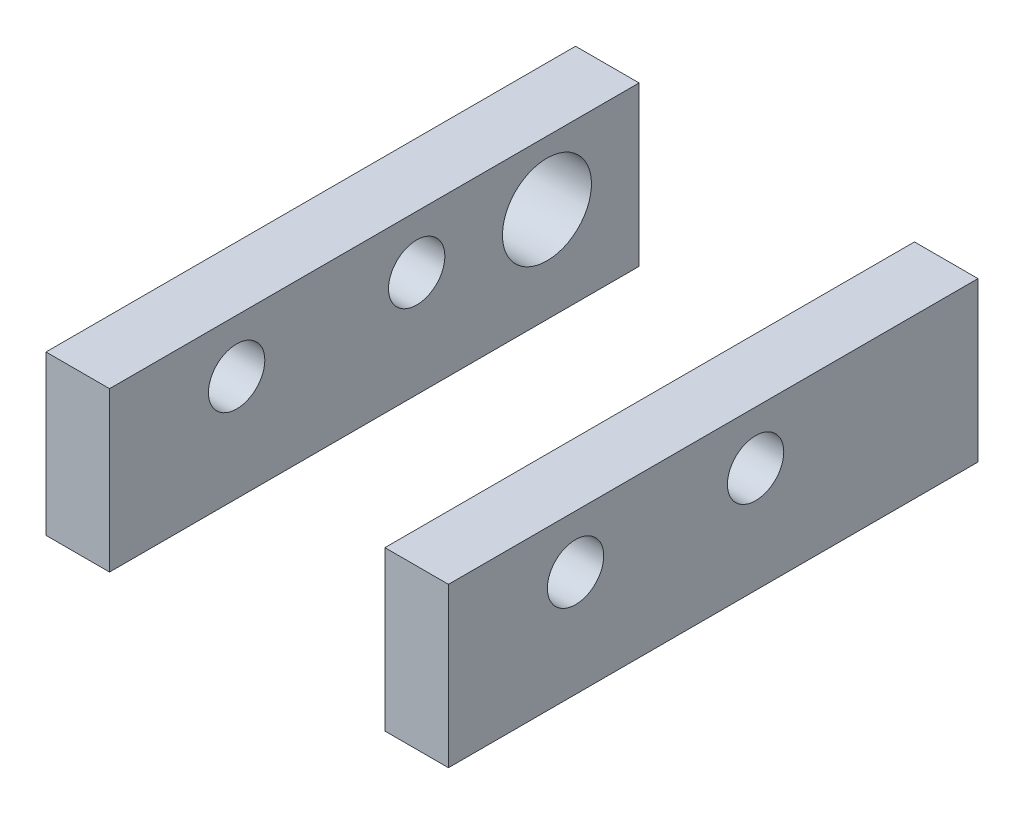
ISO-10303-21;
HEADER;
FILE_DESCRIPTION(('STEP AP214'),'2;1');
FILE_NAME('part.step','',(''),(''),'','','');
FILE_SCHEMA(('AUTOMOTIVE_DESIGN { 1 0 10303 214 1 1 1 1 }'));
ENDSEC;
DATA;
#1=APPLICATION_CONTEXT('core data for automotive mechanical design processes');
#2=APPLICATION_PROTOCOL_DEFINITION('international standard','automotive_design',2000,#1);
#3=PRODUCT_CONTEXT('',#1,'mechanical');
#4=PRODUCT('Part','Part','',(#3));
#5=PRODUCT_RELATED_PRODUCT_CATEGORY('part','',(#4));
#6=PRODUCT_DEFINITION_FORMATION('','',#4);
#7=PRODUCT_DEFINITION_CONTEXT('part definition',#1,'design');
#8=PRODUCT_DEFINITION('design','',#6,#7);
#9=PRODUCT_DEFINITION_SHAPE('','',#8);
#10=(LENGTH_UNIT() NAMED_UNIT(*) SI_UNIT(.MILLI.,.METRE.));
#11=(NAMED_UNIT(*) PLANE_ANGLE_UNIT() SI_UNIT($,.RADIAN.));
#12=(NAMED_UNIT(*) SI_UNIT($,.STERADIAN.) SOLID_ANGLE_UNIT());
#13=UNCERTAINTY_MEASURE_WITH_UNIT(LENGTH_MEASURE(1.E-05),#10,'distance_accuracy_value','');
#14=(GEOMETRIC_REPRESENTATION_CONTEXT(3) GLOBAL_UNCERTAINTY_ASSIGNED_CONTEXT((#13)) GLOBAL_UNIT_ASSIGNED_CONTEXT((#10,
#11,#12)) REPRESENTATION_CONTEXT('',''));
#15=CARTESIAN_POINT('',(0.,0.,0.));
#16=DIRECTION('',(0.,0.,1.));
#17=DIRECTION('',(1.,0.,0.));
#18=AXIS2_PLACEMENT_3D('',#15,#16,#17);
#19=CARTESIAN_POINT('',(-7.62,-2.54000000000001,63.5));
#20=DIRECTION('',(0.,1.,0.));
#21=DIRECTION('',(-1.,0.,0.));
#22=AXIS2_PLACEMENT_3D('',#19,#20,#21);
#23=PLANE('',#22);
#24=DIRECTION('',(0.,0.,-1.));
#25=VECTOR('',#24,1.);
#26=CARTESIAN_POINT('',(33.02,-2.54,63.500012));
#27=LINE('',#26,#25);
#28=CARTESIAN_POINT('',(33.02,-2.54,63.5));
#29=VERTEX_POINT('',#28);
#30=CARTESIAN_POINT('',(33.02,-2.54,0.));
#31=VERTEX_POINT('',#30);
#32=EDGE_CURVE('E133',#29,#31,#27,.T.);
#33=ORIENTED_EDGE('',*,*,#32,.T.);
#34=DIRECTION('',(1.,0.,0.));
#35=VECTOR('',#34,1.);
#36=CARTESIAN_POINT('',(-7.62,-2.54000000000001,0.));
#37=LINE('',#36,#35);
#38=CARTESIAN_POINT('',(40.64,-2.54,0.));
#39=VERTEX_POINT('',#38);
#40=EDGE_CURVE('E95',#31,#39,#37,.T.);
#41=ORIENTED_EDGE('',*,*,#40,.T.);
#42=DIRECTION('',(0.,0.,-1.));
#43=VECTOR('',#42,1.);
#44=CARTESIAN_POINT('',(40.64,-2.54,63.5));
#45=LINE('',#44,#43);
#46=CARTESIAN_POINT('',(40.64,-2.54,63.5));
#47=VERTEX_POINT('',#46);
#48=EDGE_CURVE('E110',#47,#39,#45,.T.);
#49=ORIENTED_EDGE('',*,*,#48,.F.);
#50=DIRECTION('',(1.,0.,0.));
#51=VECTOR('',#50,1.);
#52=CARTESIAN_POINT('',(-7.62,-2.54000000000001,63.5));
#53=LINE('',#52,#51);
#54=EDGE_CURVE('E131',#29,#47,#53,.T.);
#55=ORIENTED_EDGE('',*,*,#54,.F.);
#56=EDGE_LOOP('',(#33,#41,#49,#55));
#57=FACE_BOUND('',#56,.T.);
#58=ADVANCED_FACE('F51',(#57),#23,.F.);
#59=CARTESIAN_POINT('',(0.,0.,63.5));
#60=DIRECTION('',(0.,0.,-1.));
#61=DIRECTION('',(-1.,0.,0.));
#62=AXIS2_PLACEMENT_3D('',#59,#60,#61);
#63=PLANE('',#62);
#64=DIRECTION('',(0.,-1.,0.));
#65=VECTOR('',#64,1.);
#66=CARTESIAN_POINT('',(33.02,0.,63.5));
#67=LINE('',#66,#65);
#68=CARTESIAN_POINT('',(33.02,16.51,63.5));
#69=VERTEX_POINT('',#68);
#70=EDGE_CURVE('E68',#69,#29,#67,.T.);
#71=ORIENTED_EDGE('',*,*,#70,.T.);
#72=ORIENTED_EDGE('',*,*,#54,.T.);
#73=DIRECTION('',(0.,1.,0.));
#74=VECTOR('',#73,1.);
#75=CARTESIAN_POINT('',(40.64,-2.54,63.5));
#76=LINE('',#75,#74);
#77=CARTESIAN_POINT('',(40.64,16.51,63.5));
#78=VERTEX_POINT('',#77);
#79=EDGE_CURVE('E129',#47,#78,#76,.T.);
#80=ORIENTED_EDGE('',*,*,#79,.T.);
#81=DIRECTION('',(-1.,0.,0.));
#82=VECTOR('',#81,1.);
#83=CARTESIAN_POINT('',(33.02,16.51,63.5));
#84=LINE('',#83,#82);
#85=EDGE_CURVE('E126',#78,#69,#84,.T.);
#86=ORIENTED_EDGE('',*,*,#85,.T.);
#87=EDGE_LOOP('',(#71,#72,#80,#86));
#88=FACE_BOUND('',#87,.T.);
#89=ADVANCED_FACE('F169',(#88),#63,.F.);
#90=CARTESIAN_POINT('',(0.,0.,0.));
#91=DIRECTION('',(0.,0.,-1.));
#92=DIRECTION('',(-1.,0.,0.));
#93=AXIS2_PLACEMENT_3D('',#90,#91,#92);
#94=PLANE('',#93);
#95=ORIENTED_EDGE('',*,*,#40,.F.);
#96=DIRECTION('',(0.,1.,0.));
#97=VECTOR('',#96,1.);
#98=CARTESIAN_POINT('',(33.02,0.,0.));
#99=LINE('',#98,#97);
#100=CARTESIAN_POINT('',(33.02,16.51,0.));
#101=VERTEX_POINT('',#100);
#102=EDGE_CURVE('E90',#31,#101,#99,.T.);
#103=ORIENTED_EDGE('',*,*,#102,.T.);
#104=DIRECTION('',(-1.,0.,0.));
#105=VECTOR('',#104,1.);
#106=CARTESIAN_POINT('',(33.02,16.51,0.));
#107=LINE('',#106,#105);
#108=CARTESIAN_POINT('',(40.64,16.51,0.));
#109=VERTEX_POINT('',#108);
#110=EDGE_CURVE('E94',#109,#101,#107,.T.);
#111=ORIENTED_EDGE('',*,*,#110,.F.);
#112=DIRECTION('',(0.,1.,0.));
#113=VECTOR('',#112,1.);
#114=CARTESIAN_POINT('',(40.64,-2.54,0.));
#115=LINE('',#114,#113);
#116=EDGE_CURVE('E100',#39,#109,#115,.T.);
#117=ORIENTED_EDGE('',*,*,#116,.F.);
#118=EDGE_LOOP('',(#95,#103,#111,#117));
#119=FACE_BOUND('',#118,.T.);
#120=ADVANCED_FACE('F92',(#119),#94,.T.);
#121=CARTESIAN_POINT('',(40.64,-2.54,63.5));
#122=DIRECTION('',(-1.,0.,0.));
#123=DIRECTION('',(0.,0.,1.));
#124=AXIS2_PLACEMENT_3D('',#121,#122,#123);
#125=PLANE('',#124);
#126=CARTESIAN_POINT('',(40.64,10.16,26.67));
#127=DIRECTION('',(1.,0.,0.));
#128=DIRECTION('',(0.,0.,-1.));
#129=AXIS2_PLACEMENT_3D('',#126,#127,#128);
#130=CIRCLE('',#129,3.3782);
#131=CARTESIAN_POINT('',(40.64,10.16,23.2918));
#132=VERTEX_POINT('',#131);
#133=EDGE_CURVE('E147',#132,#132,#130,.T.);
#134=ORIENTED_EDGE('',*,*,#133,.F.);
#135=EDGE_LOOP('',(#134));
#136=FACE_BOUND('',#135,.T.);
#137=CARTESIAN_POINT('',(40.64,10.16,48.26));
#138=DIRECTION('',(1.,0.,0.));
#139=DIRECTION('',(0.,0.,-1.));
#140=AXIS2_PLACEMENT_3D('',#137,#138,#139);
#141=CIRCLE('',#140,3.3782);
#142=CARTESIAN_POINT('',(40.64,10.16,44.8818));
#143=VERTEX_POINT('',#142);
#144=EDGE_CURVE('E12',#143,#143,#141,.T.);
#145=ORIENTED_EDGE('',*,*,#144,.F.);
#146=EDGE_LOOP('',(#145));
#147=FACE_BOUND('',#146,.T.);
#148=ORIENTED_EDGE('',*,*,#116,.T.);
#149=DIRECTION('',(0.,0.,-1.));
#150=VECTOR('',#149,1.);
#151=CARTESIAN_POINT('',(40.64,16.51,63.5));
#152=LINE('',#151,#150);
#153=EDGE_CURVE('E108',#78,#109,#152,.T.);
#154=ORIENTED_EDGE('',*,*,#153,.F.);
#155=ORIENTED_EDGE('',*,*,#79,.F.);
#156=ORIENTED_EDGE('',*,*,#48,.T.);
#157=EDGE_LOOP('',(#148,#154,#155,#156));
#158=FACE_BOUND('',#157,.T.);
#159=ADVANCED_FACE('F144',(#136,#147,#158),#125,.F.);
#160=CARTESIAN_POINT('',(33.02,16.51,63.5));
#161=DIRECTION('',(0.,-1.,0.));
#162=DIRECTION('',(0.,0.,-1.));
#163=AXIS2_PLACEMENT_3D('',#160,#161,#162);
#164=PLANE('',#163);
#165=ORIENTED_EDGE('',*,*,#110,.T.);
#166=DIRECTION('',(0.,0.,-1.));
#167=VECTOR('',#166,1.);
#168=CARTESIAN_POINT('',(33.02,16.51,63.5));
#169=LINE('',#168,#167);
#170=EDGE_CURVE('E61',#69,#101,#169,.T.);
#171=ORIENTED_EDGE('',*,*,#170,.F.);
#172=ORIENTED_EDGE('',*,*,#85,.F.);
#173=ORIENTED_EDGE('',*,*,#153,.T.);
#174=EDGE_LOOP('',(#165,#171,#172,#173));
#175=FACE_BOUND('',#174,.T.);
#176=ADVANCED_FACE('F105',(#175),#164,.F.);
#177=CARTESIAN_POINT('',(33.02,0.,63.5));
#178=DIRECTION('',(1.,0.,0.));
#179=DIRECTION('',(0.,0.,-1.));
#180=AXIS2_PLACEMENT_3D('',#177,#178,#179);
#181=PLANE('',#180);
#182=CARTESIAN_POINT('',(33.02,10.16,26.67));
#183=DIRECTION('',(1.,0.,0.));
#184=DIRECTION('',(0.,0.,-1.));
#185=AXIS2_PLACEMENT_3D('',#182,#183,#184);
#186=CIRCLE('',#185,3.3782);
#187=CARTESIAN_POINT('',(33.02,10.16,23.2918));
#188=VERTEX_POINT('',#187);
#189=EDGE_CURVE('E54',#188,#188,#186,.T.);
#190=ORIENTED_EDGE('',*,*,#189,.T.);
#191=EDGE_LOOP('',(#190));
#192=FACE_BOUND('',#191,.T.);
#193=CARTESIAN_POINT('',(33.02,10.16,48.26));
#194=DIRECTION('',(1.,0.,0.));
#195=DIRECTION('',(0.,0.,-1.));
#196=AXIS2_PLACEMENT_3D('',#193,#194,#195);
#197=CIRCLE('',#196,3.3782);
#198=CARTESIAN_POINT('',(33.02,10.16,44.8818));
#199=VERTEX_POINT('',#198);
#200=EDGE_CURVE('E114',#199,#199,#197,.T.);
#201=ORIENTED_EDGE('',*,*,#200,.T.);
#202=EDGE_LOOP('',(#201));
#203=FACE_BOUND('',#202,.T.);
#204=ORIENTED_EDGE('',*,*,#170,.T.);
#205=ORIENTED_EDGE('',*,*,#102,.F.);
#206=ORIENTED_EDGE('',*,*,#32,.F.);
#207=ORIENTED_EDGE('',*,*,#70,.F.);
#208=EDGE_LOOP('',(#204,#205,#206,#207));
#209=FACE_BOUND('',#208,.T.);
#210=ADVANCED_FACE('F112',(#192,#203,#209),#181,.F.);
#211=CARTESIAN_POINT('',(-7.62,10.16,48.26));
#212=DIRECTION('',(1.,0.,0.));
#213=DIRECTION('',(0.,0.,-1.));
#214=AXIS2_PLACEMENT_3D('',#211,#212,#213);
#215=CYLINDRICAL_SURFACE('',#214,3.3782);
#216=ORIENTED_EDGE('',*,*,#144,.T.);
#217=EDGE_LOOP('',(#216));
#218=FACE_BOUND('',#217,.T.);
#219=ORIENTED_EDGE('',*,*,#200,.F.);
#220=EDGE_LOOP('',(#219));
#221=FACE_BOUND('',#220,.T.);
#222=ADVANCED_FACE('F160',(#218,#221),#215,.F.);
#223=CARTESIAN_POINT('',(-7.62,10.16,26.67));
#224=DIRECTION('',(1.,0.,0.));
#225=DIRECTION('',(0.,0.,-1.));
#226=AXIS2_PLACEMENT_3D('',#223,#224,#225);
#227=CYLINDRICAL_SURFACE('',#226,3.3782);
#228=ORIENTED_EDGE('',*,*,#133,.T.);
#229=EDGE_LOOP('',(#228));
#230=FACE_BOUND('',#229,.T.);
#231=ORIENTED_EDGE('',*,*,#189,.F.);
#232=EDGE_LOOP('',(#231));
#233=FACE_BOUND('',#232,.T.);
#234=ADVANCED_FACE('F158',(#230,#233),#227,.F.);
#235=CLOSED_SHELL('',(#58,#89,#120,#159,#176,#210,#222,#234));
#236=MANIFOLD_SOLID_BREP('B2',#235);
#237=CARTESIAN_POINT('',(40.641,8.89,11.049));
#238=DIRECTION('',(-1.,0.,0.));
#239=DIRECTION('',(0.,-1.,0.));
#240=AXIS2_PLACEMENT_3D('',#237,#238,#239);
#241=CYLINDRICAL_SURFACE('',#240,5.334);
#242=CARTESIAN_POINT('',(-7.62,8.89,11.049));
#243=DIRECTION('',(-1.,0.,0.));
#244=DIRECTION('',(0.,-1.,0.));
#245=AXIS2_PLACEMENT_3D('',#242,#243,#244);
#246=CIRCLE('',#245,5.334);
#247=CARTESIAN_POINT('',(-7.62,3.556,11.049));
#248=VERTEX_POINT('',#247);
#249=EDGE_CURVE('E364',#248,#248,#246,.T.);
#250=ORIENTED_EDGE('',*,*,#249,.T.);
#251=EDGE_LOOP('',(#250));
#252=FACE_BOUND('',#251,.T.);
#253=CARTESIAN_POINT('',(0.,8.89,11.049));
#254=DIRECTION('',(-1.,0.,0.));
#255=DIRECTION('',(0.,0.,1.));
#256=AXIS2_PLACEMENT_3D('',#253,#254,#255);
#257=CIRCLE('',#256,5.334);
#258=CARTESIAN_POINT('',(0.,8.89,16.383));
#259=VERTEX_POINT('',#258);
#260=EDGE_CURVE('E315',#259,#259,#257,.F.);
#261=ORIENTED_EDGE('',*,*,#260,.T.);
#262=EDGE_LOOP('',(#261));
#263=FACE_BOUND('',#262,.T.);
#264=ADVANCED_FACE('F242',(#252,#263),#241,.F.);
#265=CARTESIAN_POINT('',(-7.62,10.16,48.26));
#266=DIRECTION('',(1.,0.,0.));
#267=DIRECTION('',(0.,0.,-1.));
#268=AXIS2_PLACEMENT_3D('',#265,#266,#267);
#269=CYLINDRICAL_SURFACE('',#268,3.3782);
#270=CARTESIAN_POINT('',(-7.62,10.16,48.26));
#271=DIRECTION('',(1.,0.,0.));
#272=DIRECTION('',(0.,0.,-1.));
#273=AXIS2_PLACEMENT_3D('',#270,#271,#272);
#274=CIRCLE('',#273,3.3782);
#275=CARTESIAN_POINT('',(-7.62,10.16,44.8818));
#276=VERTEX_POINT('',#275);
#277=EDGE_CURVE('E304',#276,#276,#274,.T.);
#278=ORIENTED_EDGE('',*,*,#277,.F.);
#279=EDGE_LOOP('',(#278));
#280=FACE_BOUND('',#279,.T.);
#281=CARTESIAN_POINT('',(0.,10.16,48.26));
#282=DIRECTION('',(-1.,0.,0.));
#283=DIRECTION('',(0.,0.,1.));
#284=AXIS2_PLACEMENT_3D('',#281,#282,#283);
#285=CIRCLE('',#284,3.3782);
#286=CARTESIAN_POINT('',(0.,10.16,51.6382));
#287=VERTEX_POINT('',#286);
#288=EDGE_CURVE('E361',#287,#287,#285,.T.);
#289=ORIENTED_EDGE('',*,*,#288,.F.);
#290=EDGE_LOOP('',(#289));
#291=FACE_BOUND('',#290,.T.);
#292=ADVANCED_FACE('F323',(#280,#291),#269,.F.);
#293=CARTESIAN_POINT('',(-7.62,16.51,63.5));
#294=DIRECTION('',(0.,-1.,0.));
#295=DIRECTION('',(0.,0.,-1.));
#296=AXIS2_PLACEMENT_3D('',#293,#294,#295);
#297=PLANE('',#296);
#298=DIRECTION('',(-1.,0.,0.));
#299=VECTOR('',#298,1.);
#300=CARTESIAN_POINT('',(-7.62,16.51,0.));
#301=LINE('',#300,#299);
#302=CARTESIAN_POINT('',(0.,16.51,0.));
#303=VERTEX_POINT('',#302);
#304=CARTESIAN_POINT('',(-7.62,16.51,0.));
#305=VERTEX_POINT('',#304);
#306=EDGE_CURVE('E314',#303,#305,#301,.T.);
#307=ORIENTED_EDGE('',*,*,#306,.T.);
#308=DIRECTION('',(0.,0.,-1.));
#309=VECTOR('',#308,1.);
#310=CARTESIAN_POINT('',(-7.62,16.51,63.5));
#311=LINE('',#310,#309);
#312=CARTESIAN_POINT('',(-7.62,16.51,63.5));
#313=VERTEX_POINT('',#312);
#314=EDGE_CURVE('E251',#313,#305,#311,.T.);
#315=ORIENTED_EDGE('',*,*,#314,.F.);
#316=DIRECTION('',(-1.,0.,0.));
#317=VECTOR('',#316,1.);
#318=CARTESIAN_POINT('',(-7.62,16.51,63.5));
#319=LINE('',#318,#317);
#320=CARTESIAN_POINT('',(0.,16.51,63.5));
#321=VERTEX_POINT('',#320);
#322=EDGE_CURVE('E288',#321,#313,#319,.T.);
#323=ORIENTED_EDGE('',*,*,#322,.F.);
#324=DIRECTION('',(0.,0.,-1.));
#325=VECTOR('',#324,1.);
#326=CARTESIAN_POINT('',(0.,16.51,63.5));
#327=LINE('',#326,#325);
#328=EDGE_CURVE('E49',#321,#303,#327,.T.);
#329=ORIENTED_EDGE('',*,*,#328,.T.);
#330=EDGE_LOOP('',(#307,#315,#323,#329));
#331=FACE_BOUND('',#330,.T.);
#332=ADVANCED_FACE('F321',(#331),#297,.F.);
#333=CARTESIAN_POINT('',(-7.62,-2.54000000000001,63.5));
#334=DIRECTION('',(1.,0.,0.));
#335=DIRECTION('',(0.,1.,0.));
#336=AXIS2_PLACEMENT_3D('',#333,#334,#335);
#337=PLANE('',#336);
#338=CARTESIAN_POINT('',(-7.62,10.16,26.67));
#339=DIRECTION('',(1.,0.,0.));
#340=DIRECTION('',(0.,0.,-1.));
#341=AXIS2_PLACEMENT_3D('',#338,#339,#340);
#342=CIRCLE('',#341,3.3782);
#343=CARTESIAN_POINT('',(-7.62,10.16,23.2918));
#344=VERTEX_POINT('',#343);
#345=EDGE_CURVE('E371',#344,#344,#342,.T.);
#346=ORIENTED_EDGE('',*,*,#345,.T.);
#347=EDGE_LOOP('',(#346));
#348=FACE_BOUND('',#347,.T.);
#349=ORIENTED_EDGE('',*,*,#277,.T.);
#350=EDGE_LOOP('',(#349));
#351=FACE_BOUND('',#350,.T.);
#352=ORIENTED_EDGE('',*,*,#249,.F.);
#353=EDGE_LOOP('',(#352));
#354=FACE_BOUND('',#353,.T.);
#355=DIRECTION('',(0.,-1.,0.));
#356=VECTOR('',#355,1.);
#357=CARTESIAN_POINT('',(-7.62,-2.54000000000001,0.));
#358=LINE('',#357,#356);
#359=CARTESIAN_POINT('',(-7.62,-2.54000000000001,0.));
#360=VERTEX_POINT('',#359);
#361=EDGE_CURVE('E283',#305,#360,#358,.T.);
#362=ORIENTED_EDGE('',*,*,#361,.T.);
#363=DIRECTION('',(0.,0.,-1.));
#364=VECTOR('',#363,1.);
#365=CARTESIAN_POINT('',(-7.62,-2.54000000000001,63.5));
#366=LINE('',#365,#364);
#367=CARTESIAN_POINT('',(-7.62,-2.54000000000001,63.5));
#368=VERTEX_POINT('',#367);
#369=EDGE_CURVE('E307',#368,#360,#366,.T.);
#370=ORIENTED_EDGE('',*,*,#369,.F.);
#371=DIRECTION('',(0.,-1.,0.));
#372=VECTOR('',#371,1.);
#373=CARTESIAN_POINT('',(-7.62,-2.54000000000001,63.5));
#374=LINE('',#373,#372);
#375=EDGE_CURVE('E267',#313,#368,#374,.T.);
#376=ORIENTED_EDGE('',*,*,#375,.F.);
#377=ORIENTED_EDGE('',*,*,#314,.T.);
#378=EDGE_LOOP('',(#362,#370,#376,#377));
#379=FACE_BOUND('',#378,.T.);
#380=ADVANCED_FACE('F319',(#348,#351,#354,#379),#337,.F.);
#381=CARTESIAN_POINT('',(0.,0.,63.5));
#382=DIRECTION('',(0.,0.,-1.));
#383=DIRECTION('',(-1.,0.,0.));
#384=AXIS2_PLACEMENT_3D('',#381,#382,#383);
#385=PLANE('',#384);
#386=DIRECTION('',(1.,0.,0.));
#387=VECTOR('',#386,1.);
#388=CARTESIAN_POINT('',(-7.62,-2.54000000000001,63.5));
#389=LINE('',#388,#387);
#390=CARTESIAN_POINT('',(0.,-2.54000000000001,63.5));
#391=VERTEX_POINT('',#390);
#392=EDGE_CURVE('E303',#368,#391,#389,.T.);
#393=ORIENTED_EDGE('',*,*,#392,.T.);
#394=DIRECTION('',(0.,1.,0.));
#395=VECTOR('',#394,1.);
#396=CARTESIAN_POINT('',(0.,0.,63.5));
#397=LINE('',#396,#395);
#398=EDGE_CURVE('E294',#391,#321,#397,.T.);
#399=ORIENTED_EDGE('',*,*,#398,.T.);
#400=ORIENTED_EDGE('',*,*,#322,.T.);
#401=ORIENTED_EDGE('',*,*,#375,.T.);
#402=EDGE_LOOP('',(#393,#399,#400,#401));
#403=FACE_BOUND('',#402,.T.);
#404=ADVANCED_FACE('F306',(#403),#385,.F.);
#405=CARTESIAN_POINT('',(0.,0.,0.));
#406=DIRECTION('',(0.,0.,-1.));
#407=DIRECTION('',(-1.,0.,0.));
#408=AXIS2_PLACEMENT_3D('',#405,#406,#407);
#409=PLANE('',#408);
#410=DIRECTION('',(0.,1.,0.));
#411=VECTOR('',#410,1.);
#412=CARTESIAN_POINT('',(0.,0.,0.));
#413=LINE('',#412,#411);
#414=CARTESIAN_POINT('',(0.,-2.54000000000001,0.));
#415=VERTEX_POINT('',#414);
#416=EDGE_CURVE('E258',#415,#303,#413,.T.);
#417=ORIENTED_EDGE('',*,*,#416,.F.);
#418=DIRECTION('',(1.,0.,0.));
#419=VECTOR('',#418,1.);
#420=CARTESIAN_POINT('',(-7.62,-2.54000000000001,0.));
#421=LINE('',#420,#419);
#422=EDGE_CURVE('E298',#360,#415,#421,.T.);
#423=ORIENTED_EDGE('',*,*,#422,.F.);
#424=ORIENTED_EDGE('',*,*,#361,.F.);
#425=ORIENTED_EDGE('',*,*,#306,.F.);
#426=EDGE_LOOP('',(#417,#423,#424,#425));
#427=FACE_BOUND('',#426,.T.);
#428=ADVANCED_FACE('F320',(#427),#409,.T.);
#429=CARTESIAN_POINT('',(0.,0.,63.5));
#430=DIRECTION('',(-1.,0.,0.));
#431=DIRECTION('',(0.,0.,1.));
#432=AXIS2_PLACEMENT_3D('',#429,#430,#431);
#433=PLANE('',#432);
#434=CARTESIAN_POINT('',(0.,10.16,26.67));
#435=DIRECTION('',(-1.,0.,0.));
#436=DIRECTION('',(0.,0.,1.));
#437=AXIS2_PLACEMENT_3D('',#434,#435,#436);
#438=CIRCLE('',#437,3.3782);
#439=CARTESIAN_POINT('',(0.,10.16,30.0482));
#440=VERTEX_POINT('',#439);
#441=EDGE_CURVE('E246',#440,#440,#438,.T.);
#442=ORIENTED_EDGE('',*,*,#441,.T.);
#443=EDGE_LOOP('',(#442));
#444=FACE_BOUND('',#443,.T.);
#445=ORIENTED_EDGE('',*,*,#288,.T.);
#446=EDGE_LOOP('',(#445));
#447=FACE_BOUND('',#446,.T.);
#448=ORIENTED_EDGE('',*,*,#260,.F.);
#449=EDGE_LOOP('',(#448));
#450=FACE_BOUND('',#449,.T.);
#451=ORIENTED_EDGE('',*,*,#416,.T.);
#452=ORIENTED_EDGE('',*,*,#328,.F.);
#453=ORIENTED_EDGE('',*,*,#398,.F.);
#454=DIRECTION('',(0.,0.,-1.));
#455=VECTOR('',#454,1.);
#456=CARTESIAN_POINT('',(0.,-2.54000000000001,63.500012));
#457=LINE('',#456,#455);
#458=EDGE_CURVE('E296',#391,#415,#457,.T.);
#459=ORIENTED_EDGE('',*,*,#458,.T.);
#460=EDGE_LOOP('',(#451,#452,#453,#459));
#461=FACE_BOUND('',#460,.T.);
#462=ADVANCED_FACE('F244',(#444,#447,#450,#461),#433,.F.);
#463=CARTESIAN_POINT('',(-7.62,-2.54000000000001,63.5));
#464=DIRECTION('',(0.,1.,0.));
#465=DIRECTION('',(-1.,0.,0.));
#466=AXIS2_PLACEMENT_3D('',#463,#464,#465);
#467=PLANE('',#466);
#468=ORIENTED_EDGE('',*,*,#458,.F.);
#469=ORIENTED_EDGE('',*,*,#392,.F.);
#470=ORIENTED_EDGE('',*,*,#369,.T.);
#471=ORIENTED_EDGE('',*,*,#422,.T.);
#472=EDGE_LOOP('',(#468,#469,#470,#471));
#473=FACE_BOUND('',#472,.T.);
#474=ADVANCED_FACE('F302',(#473),#467,.F.);
#475=CARTESIAN_POINT('',(-7.62,10.16,26.67));
#476=DIRECTION('',(1.,0.,0.));
#477=DIRECTION('',(0.,0.,-1.));
#478=AXIS2_PLACEMENT_3D('',#475,#476,#477);
#479=CYLINDRICAL_SURFACE('',#478,3.3782);
#480=ORIENTED_EDGE('',*,*,#345,.F.);
#481=EDGE_LOOP('',(#480));
#482=FACE_BOUND('',#481,.T.);
#483=ORIENTED_EDGE('',*,*,#441,.F.);
#484=EDGE_LOOP('',(#483));
#485=FACE_BOUND('',#484,.T.);
#486=ADVANCED_FACE('F346',(#482,#485),#479,.F.);
#487=CLOSED_SHELL('',(#264,#292,#332,#380,#404,#428,#462,#474,#486));
#488=MANIFOLD_SOLID_BREP('B6',#487);
#489=ADVANCED_BREP_SHAPE_REPRESENTATION('',(#18,#236,#488),#14);
#490=SHAPE_DEFINITION_REPRESENTATION(#9,#489);
ENDSEC;
END-ISO-10303-21;
